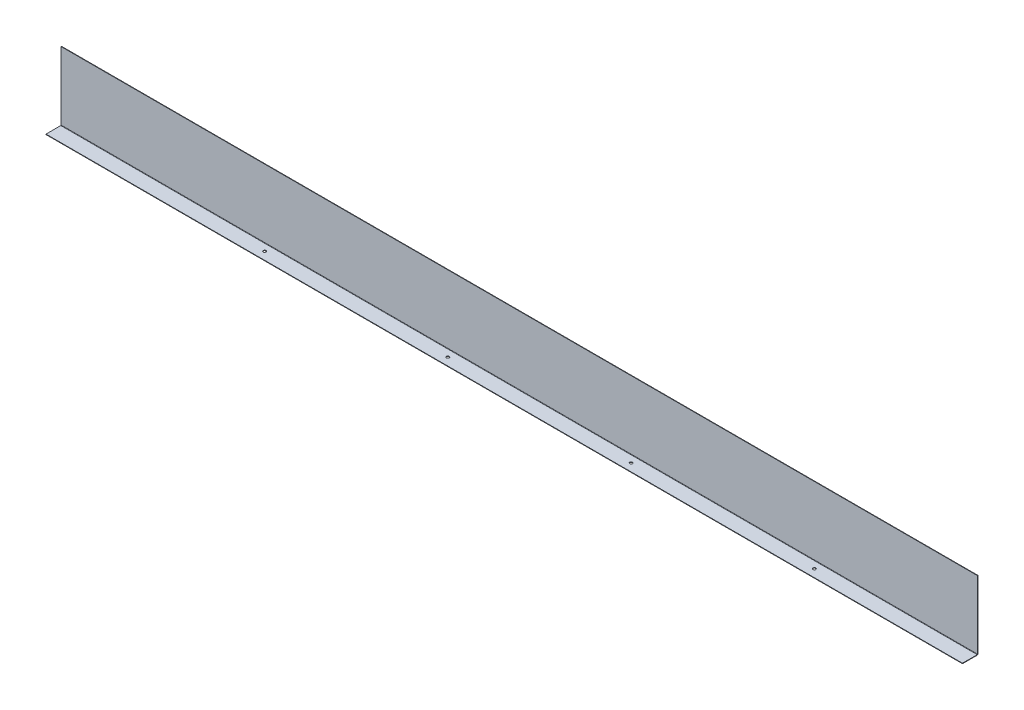
ISO-10303-21;
HEADER;
FILE_DESCRIPTION(('STEP AP214'),'2;1');
FILE_NAME('part.step','',(''),(''),'','','');
FILE_SCHEMA(('AUTOMOTIVE_DESIGN { 1 0 10303 214 1 1 1 1 }'));
ENDSEC;
DATA;
#1=APPLICATION_CONTEXT('core data for automotive mechanical design processes');
#2=APPLICATION_PROTOCOL_DEFINITION('international standard','automotive_design',2000,#1);
#3=PRODUCT_CONTEXT('',#1,'mechanical');
#4=PRODUCT('Part','Part','',(#3));
#5=PRODUCT_RELATED_PRODUCT_CATEGORY('part','',(#4));
#6=PRODUCT_DEFINITION_FORMATION('','',#4);
#7=PRODUCT_DEFINITION_CONTEXT('part definition',#1,'design');
#8=PRODUCT_DEFINITION('design','',#6,#7);
#9=PRODUCT_DEFINITION_SHAPE('','',#8);
#10=(LENGTH_UNIT() NAMED_UNIT(*) SI_UNIT(.MILLI.,.METRE.));
#11=(NAMED_UNIT(*) PLANE_ANGLE_UNIT() SI_UNIT($,.RADIAN.));
#12=(NAMED_UNIT(*) SI_UNIT($,.STERADIAN.) SOLID_ANGLE_UNIT());
#13=UNCERTAINTY_MEASURE_WITH_UNIT(LENGTH_MEASURE(1.E-05),#10,'distance_accuracy_value','');
#14=(GEOMETRIC_REPRESENTATION_CONTEXT(3) GLOBAL_UNCERTAINTY_ASSIGNED_CONTEXT((#13)) GLOBAL_UNIT_ASSIGNED_CONTEXT((#10,
#11,#12)) REPRESENTATION_CONTEXT('',''));
#15=CARTESIAN_POINT('',(0.,0.,0.));
#16=DIRECTION('',(0.,0.,1.));
#17=DIRECTION('',(1.,0.,0.));
#18=AXIS2_PLACEMENT_3D('',#15,#16,#17);
#19=CARTESIAN_POINT('',(2000.,-1.,0.));
#20=DIRECTION('',(0.,1.,0.));
#21=DIRECTION('',(0.,0.,1.));
#22=AXIS2_PLACEMENT_3D('',#19,#20,#21);
#23=PLANE('',#22);
#24=CARTESIAN_POINT('',(460.,-0.999999999999999,-16.95));
#25=DIRECTION('',(0.,1.,0.));
#26=DIRECTION('',(0.,0.,1.));
#27=AXIS2_PLACEMENT_3D('',#24,#25,#26);
#28=CIRCLE('',#27,2.99999999999999);
#29=CARTESIAN_POINT('',(460.,-0.999999999999999,-13.95));
#30=VERTEX_POINT('',#29);
#31=EDGE_CURVE('E229',#30,#30,#28,.T.);
#32=ORIENTED_EDGE('',*,*,#31,.T.);
#33=EDGE_LOOP('',(#32));
#34=FACE_BOUND('',#33,.T.);
#35=CARTESIAN_POINT('',(1260.,-0.999999999999999,-16.95));
#36=DIRECTION('',(0.,1.,0.));
#37=DIRECTION('',(0.,0.,1.));
#38=AXIS2_PLACEMENT_3D('',#35,#36,#37);
#39=CIRCLE('',#38,2.99999999999993);
#40=CARTESIAN_POINT('',(1260.,-0.999999999999999,-13.9500000000001));
#41=VERTEX_POINT('',#40);
#42=EDGE_CURVE('E233',#41,#41,#39,.T.);
#43=ORIENTED_EDGE('',*,*,#42,.T.);
#44=EDGE_LOOP('',(#43));
#45=FACE_BOUND('',#44,.T.);
#46=CARTESIAN_POINT('',(1660.,-0.999999999999999,-16.95));
#47=DIRECTION('',(0.,1.,0.));
#48=DIRECTION('',(0.,0.,1.));
#49=AXIS2_PLACEMENT_3D('',#46,#47,#48);
#50=CIRCLE('',#49,2.99999999999993);
#51=CARTESIAN_POINT('',(1660.,-0.999999999999999,-13.9500000000001));
#52=VERTEX_POINT('',#51);
#53=EDGE_CURVE('E237',#52,#52,#50,.T.);
#54=ORIENTED_EDGE('',*,*,#53,.T.);
#55=EDGE_LOOP('',(#54));
#56=FACE_BOUND('',#55,.T.);
#57=CARTESIAN_POINT('',(860.,-0.999999999999999,-16.95));
#58=DIRECTION('',(0.,1.,0.));
#59=DIRECTION('',(0.,0.,1.));
#60=AXIS2_PLACEMENT_3D('',#57,#58,#59);
#61=CIRCLE('',#60,3.00000000000005);
#62=CARTESIAN_POINT('',(860.,-0.999999999999999,-13.95));
#63=VERTEX_POINT('',#62);
#64=EDGE_CURVE('E164',#63,#63,#61,.T.);
#65=ORIENTED_EDGE('',*,*,#64,.T.);
#66=EDGE_LOOP('',(#65));
#67=FACE_BOUND('',#66,.T.);
#68=DIRECTION('',(-1.,0.,0.));
#69=VECTOR('',#68,1.);
#70=CARTESIAN_POINT('',(0.,-1.00000000000013,-32.1634));
#71=LINE('',#70,#69);
#72=CARTESIAN_POINT('',(0.,-1.00000000000013,-32.1634));
#73=VERTEX_POINT('',#72);
#74=CARTESIAN_POINT('',(2000.,-1.,-32.1634));
#75=VERTEX_POINT('',#74);
#76=EDGE_CURVE('E87',#73,#75,#71,.F.);
#77=ORIENTED_EDGE('',*,*,#76,.T.);
#78=DIRECTION('',(0.,0.,-1.));
#79=VECTOR('',#78,1.);
#80=CARTESIAN_POINT('',(2000.,-1.,0.));
#81=LINE('',#80,#79);
#82=CARTESIAN_POINT('',(2000.,-1.,0.));
#83=VERTEX_POINT('',#82);
#84=EDGE_CURVE('E188',#83,#75,#81,.T.);
#85=ORIENTED_EDGE('',*,*,#84,.F.);
#86=DIRECTION('',(-1.,0.,0.));
#87=VECTOR('',#86,1.);
#88=CARTESIAN_POINT('',(2000.,-1.,0.));
#89=LINE('',#88,#87);
#90=CARTESIAN_POINT('',(0.,-1.,0.));
#91=VERTEX_POINT('',#90);
#92=EDGE_CURVE('E67',#83,#91,#89,.T.);
#93=ORIENTED_EDGE('',*,*,#92,.T.);
#94=DIRECTION('',(0.,0.,-1.));
#95=VECTOR('',#94,1.);
#96=CARTESIAN_POINT('',(0.,-1.,0.));
#97=LINE('',#96,#95);
#98=EDGE_CURVE('E185',#91,#73,#97,.T.);
#99=ORIENTED_EDGE('',*,*,#98,.T.);
#100=EDGE_LOOP('',(#77,#85,#93,#99));
#101=FACE_BOUND('',#100,.T.);
#102=ADVANCED_FACE('F59',(#34,#45,#56,#67,#101),#23,.F.);
#103=CARTESIAN_POINT('',(2000.,0.,0.));
#104=DIRECTION('',(0.,1.,0.));
#105=DIRECTION('',(0.,0.,1.));
#106=AXIS2_PLACEMENT_3D('',#103,#104,#105);
#107=PLANE('',#106);
#108=CARTESIAN_POINT('',(460.,0.,-16.95));
#109=DIRECTION('',(0.,1.,0.));
#110=DIRECTION('',(0.,0.,1.));
#111=AXIS2_PLACEMENT_3D('',#108,#109,#110);
#112=CIRCLE('',#111,2.99999999999999);
#113=CARTESIAN_POINT('',(460.,0.,-13.95));
#114=VERTEX_POINT('',#113);
#115=EDGE_CURVE('E427',#114,#114,#112,.T.);
#116=ORIENTED_EDGE('',*,*,#115,.F.);
#117=EDGE_LOOP('',(#116));
#118=FACE_BOUND('',#117,.T.);
#119=CARTESIAN_POINT('',(1260.,0.,-16.95));
#120=DIRECTION('',(0.,1.,0.));
#121=DIRECTION('',(0.,0.,1.));
#122=AXIS2_PLACEMENT_3D('',#119,#120,#121);
#123=CIRCLE('',#122,2.99999999999993);
#124=CARTESIAN_POINT('',(1260.,0.,-13.9500000000001));
#125=VERTEX_POINT('',#124);
#126=EDGE_CURVE('E434',#125,#125,#123,.T.);
#127=ORIENTED_EDGE('',*,*,#126,.F.);
#128=EDGE_LOOP('',(#127));
#129=FACE_BOUND('',#128,.T.);
#130=CARTESIAN_POINT('',(1660.,0.,-16.95));
#131=DIRECTION('',(0.,1.,0.));
#132=DIRECTION('',(0.,0.,1.));
#133=AXIS2_PLACEMENT_3D('',#130,#131,#132);
#134=CIRCLE('',#133,2.99999999999993);
#135=CARTESIAN_POINT('',(1660.,0.,-13.9500000000001));
#136=VERTEX_POINT('',#135);
#137=EDGE_CURVE('E431',#136,#136,#134,.T.);
#138=ORIENTED_EDGE('',*,*,#137,.F.);
#139=EDGE_LOOP('',(#138));
#140=FACE_BOUND('',#139,.T.);
#141=CARTESIAN_POINT('',(860.,0.,-16.95));
#142=DIRECTION('',(0.,1.,0.));
#143=DIRECTION('',(0.,0.,1.));
#144=AXIS2_PLACEMENT_3D('',#141,#142,#143);
#145=CIRCLE('',#144,3.00000000000005);
#146=CARTESIAN_POINT('',(860.,0.,-13.95));
#147=VERTEX_POINT('',#146);
#148=EDGE_CURVE('E241',#147,#147,#145,.T.);
#149=ORIENTED_EDGE('',*,*,#148,.F.);
#150=EDGE_LOOP('',(#149));
#151=FACE_BOUND('',#150,.T.);
#152=DIRECTION('',(0.,0.,-1.));
#153=VECTOR('',#152,1.);
#154=CARTESIAN_POINT('',(2000.,0.,0.));
#155=LINE('',#154,#153);
#156=CARTESIAN_POINT('',(2000.,0.,0.));
#157=VERTEX_POINT('',#156);
#158=CARTESIAN_POINT('',(2000.,0.,-32.1634));
#159=VERTEX_POINT('',#158);
#160=EDGE_CURVE('E190',#157,#159,#155,.T.);
#161=ORIENTED_EDGE('',*,*,#160,.T.);
#162=DIRECTION('',(-1.,0.,0.));
#163=VECTOR('',#162,1.);
#164=CARTESIAN_POINT('',(0.,-1.27285335049798E-13,-32.1634));
#165=LINE('',#164,#163);
#166=CARTESIAN_POINT('',(0.,-1.27285335049798E-13,-32.1634));
#167=VERTEX_POINT('',#166);
#168=EDGE_CURVE('E176',#167,#159,#165,.F.);
#169=ORIENTED_EDGE('',*,*,#168,.F.);
#170=DIRECTION('',(0.,0.,-1.));
#171=VECTOR('',#170,1.);
#172=CARTESIAN_POINT('',(0.,0.,0.));
#173=LINE('',#172,#171);
#174=CARTESIAN_POINT('',(0.,0.,0.));
#175=VERTEX_POINT('',#174);
#176=EDGE_CURVE('E197',#175,#167,#173,.T.);
#177=ORIENTED_EDGE('',*,*,#176,.F.);
#178=DIRECTION('',(-1.,0.,0.));
#179=VECTOR('',#178,1.);
#180=CARTESIAN_POINT('',(2000.,0.,0.));
#181=LINE('',#180,#179);
#182=EDGE_CURVE('E13',#157,#175,#181,.T.);
#183=ORIENTED_EDGE('',*,*,#182,.F.);
#184=EDGE_LOOP('',(#161,#169,#177,#183));
#185=FACE_BOUND('',#184,.T.);
#186=ADVANCED_FACE('F220',(#118,#129,#140,#151,#185),#107,.T.);
#187=CARTESIAN_POINT('',(2000.,0.,0.));
#188=DIRECTION('',(-1.,0.,0.));
#189=DIRECTION('',(0.,0.,1.));
#190=AXIS2_PLACEMENT_3D('',#187,#188,#189);
#191=PLANE('',#190);
#192=DIRECTION('',(0.,-1.,0.));
#193=VECTOR('',#192,1.);
#194=CARTESIAN_POINT('',(2000.,0.,-32.1634));
#195=LINE('',#194,#193);
#196=EDGE_CURVE('E182',#159,#75,#195,.T.);
#197=ORIENTED_EDGE('',*,*,#196,.F.);
#198=ORIENTED_EDGE('',*,*,#160,.F.);
#199=DIRECTION('',(0.,1.,0.));
#200=VECTOR('',#199,1.);
#201=CARTESIAN_POINT('',(2000.,-1.,0.));
#202=LINE('',#201,#200);
#203=EDGE_CURVE('E194',#83,#157,#202,.T.);
#204=ORIENTED_EDGE('',*,*,#203,.F.);
#205=ORIENTED_EDGE('',*,*,#84,.T.);
#206=EDGE_LOOP('',(#197,#198,#204,#205));
#207=FACE_BOUND('',#206,.T.);
#208=ADVANCED_FACE('F217',(#207),#191,.F.);
#209=CARTESIAN_POINT('',(0.,0.,0.));
#210=DIRECTION('',(-1.,0.,0.));
#211=DIRECTION('',(0.,0.,1.));
#212=AXIS2_PLACEMENT_3D('',#209,#210,#211);
#213=PLANE('',#212);
#214=ORIENTED_EDGE('',*,*,#176,.T.);
#215=DIRECTION('',(0.,-1.,0.));
#216=VECTOR('',#215,1.);
#217=CARTESIAN_POINT('',(0.,-1.27285335049798E-13,-32.1634));
#218=LINE('',#217,#216);
#219=EDGE_CURVE('E170',#167,#73,#218,.T.);
#220=ORIENTED_EDGE('',*,*,#219,.T.);
#221=ORIENTED_EDGE('',*,*,#98,.F.);
#222=DIRECTION('',(0.,1.,0.));
#223=VECTOR('',#222,1.);
#224=CARTESIAN_POINT('',(0.,-1.,0.));
#225=LINE('',#224,#223);
#226=EDGE_CURVE('E191',#91,#175,#225,.T.);
#227=ORIENTED_EDGE('',*,*,#226,.T.);
#228=EDGE_LOOP('',(#214,#220,#221,#227));
#229=FACE_BOUND('',#228,.T.);
#230=ADVANCED_FACE('F204',(#229),#213,.T.);
#231=CARTESIAN_POINT('',(2000.,-1.,0.));
#232=DIRECTION('',(0.,0.,1.));
#233=DIRECTION('',(1.,0.,0.));
#234=AXIS2_PLACEMENT_3D('',#231,#232,#233);
#235=PLANE('',#234);
#236=ORIENTED_EDGE('',*,*,#226,.F.);
#237=ORIENTED_EDGE('',*,*,#92,.F.);
#238=ORIENTED_EDGE('',*,*,#203,.T.);
#239=ORIENTED_EDGE('',*,*,#182,.T.);
#240=EDGE_LOOP('',(#236,#237,#238,#239));
#241=FACE_BOUND('',#240,.T.);
#242=ADVANCED_FACE('F206',(#241),#235,.T.);
#243=CARTESIAN_POINT('',(2000.,0.736600000000017,-32.1634));
#244=DIRECTION('',(1.,0.,0.));
#245=DIRECTION('',(0.,1.,0.));
#246=AXIS2_PLACEMENT_3D('',#243,#244,#245);
#247=PLANE('',#246);
#248=DIRECTION('',(0.,0.,1.));
#249=VECTOR('',#248,1.);
#250=CARTESIAN_POINT('',(2000.,0.736600000000004,-33.9));
#251=LINE('',#250,#249);
#252=CARTESIAN_POINT('',(2000.,0.736600000000014,-32.9));
#253=VERTEX_POINT('',#252);
#254=CARTESIAN_POINT('',(2000.,0.736600000000011,-33.9));
#255=VERTEX_POINT('',#254);
#256=EDGE_CURVE('E147',#253,#255,#251,.F.);
#257=ORIENTED_EDGE('',*,*,#256,.F.);
#258=CARTESIAN_POINT('',(2000.,0.736600000000017,-32.1634));
#259=DIRECTION('',(-1.,0.,0.));
#260=DIRECTION('',(0.,-1.,0.));
#261=AXIS2_PLACEMENT_3D('',#258,#259,#260);
#262=CIRCLE('',#261,0.736599999999997);
#263=EDGE_CURVE('E173',#159,#253,#262,.F.);
#264=ORIENTED_EDGE('',*,*,#263,.F.);
#265=ORIENTED_EDGE('',*,*,#196,.T.);
#266=CARTESIAN_POINT('',(2000.,0.736600000000017,-32.1634));
#267=DIRECTION('',(-1.,0.,0.));
#268=DIRECTION('',(0.,-1.,0.));
#269=AXIS2_PLACEMENT_3D('',#266,#267,#268);
#270=CIRCLE('',#269,1.7366);
#271=EDGE_CURVE('E166',#75,#255,#270,.F.);
#272=ORIENTED_EDGE('',*,*,#271,.T.);
#273=EDGE_LOOP('',(#257,#264,#265,#272));
#274=FACE_BOUND('',#273,.T.);
#275=ADVANCED_FACE('F208',(#274),#247,.T.);
#276=CARTESIAN_POINT('',(0.,0.73659999999987,-32.1634));
#277=DIRECTION('',(1.,0.,0.));
#278=DIRECTION('',(0.,1.,0.));
#279=AXIS2_PLACEMENT_3D('',#276,#277,#278);
#280=PLANE('',#279);
#281=CARTESIAN_POINT('',(0.,0.73659999999987,-32.1634));
#282=DIRECTION('',(-1.,0.,0.));
#283=DIRECTION('',(0.,-1.,0.));
#284=AXIS2_PLACEMENT_3D('',#281,#282,#283);
#285=CIRCLE('',#284,0.736599999999997);
#286=CARTESIAN_POINT('',(0.,0.736599999999867,-32.9));
#287=VERTEX_POINT('',#286);
#288=EDGE_CURVE('E179',#287,#167,#285,.T.);
#289=ORIENTED_EDGE('',*,*,#288,.F.);
#290=DIRECTION('',(0.,0.,1.));
#291=VECTOR('',#290,1.);
#292=CARTESIAN_POINT('',(0.,0.7365999999999,-32.9));
#293=LINE('',#292,#291);
#294=CARTESIAN_POINT('',(0.,0.736599999999907,-33.9));
#295=VERTEX_POINT('',#294);
#296=EDGE_CURVE('E158',#287,#295,#293,.F.);
#297=ORIENTED_EDGE('',*,*,#296,.T.);
#298=CARTESIAN_POINT('',(0.,0.73659999999987,-32.1634));
#299=DIRECTION('',(-1.,0.,0.));
#300=DIRECTION('',(0.,-1.,0.));
#301=AXIS2_PLACEMENT_3D('',#298,#299,#300);
#302=CIRCLE('',#301,1.7366);
#303=EDGE_CURVE('E167',#295,#73,#302,.T.);
#304=ORIENTED_EDGE('',*,*,#303,.T.);
#305=ORIENTED_EDGE('',*,*,#219,.F.);
#306=EDGE_LOOP('',(#289,#297,#304,#305));
#307=FACE_BOUND('',#306,.T.);
#308=ADVANCED_FACE('F214',(#307),#280,.F.);
#309=CARTESIAN_POINT('',(0.,0.73659999999987,-32.1634));
#310=DIRECTION('',(-1.,0.,0.));
#311=DIRECTION('',(0.,0.,-1.));
#312=AXIS2_PLACEMENT_3D('',#309,#310,#311);
#313=CYLINDRICAL_SURFACE('',#312,1.7366);
#314=ORIENTED_EDGE('',*,*,#76,.F.);
#315=ORIENTED_EDGE('',*,*,#303,.F.);
#316=DIRECTION('',(-1.,0.,0.));
#317=VECTOR('',#316,1.);
#318=CARTESIAN_POINT('',(2000.,0.736600000000004,-33.9));
#319=LINE('',#318,#317);
#320=EDGE_CURVE('E156',#295,#255,#319,.F.);
#321=ORIENTED_EDGE('',*,*,#320,.T.);
#322=ORIENTED_EDGE('',*,*,#271,.F.);
#323=EDGE_LOOP('',(#314,#315,#321,#322));
#324=FACE_BOUND('',#323,.T.);
#325=ADVANCED_FACE('F270',(#324),#313,.T.);
#326=CARTESIAN_POINT('',(0.,0.73659999999987,-32.1634));
#327=DIRECTION('',(-1.,0.,0.));
#328=DIRECTION('',(0.,0.,-1.));
#329=AXIS2_PLACEMENT_3D('',#326,#327,#328);
#330=CYLINDRICAL_SURFACE('',#329,0.736599999999997);
#331=ORIENTED_EDGE('',*,*,#168,.T.);
#332=ORIENTED_EDGE('',*,*,#263,.T.);
#333=DIRECTION('',(-1.,0.,0.));
#334=VECTOR('',#333,1.);
#335=CARTESIAN_POINT('',(2000.,0.736599999999997,-32.9));
#336=LINE('',#335,#334);
#337=EDGE_CURVE('E161',#253,#287,#336,.T.);
#338=ORIENTED_EDGE('',*,*,#337,.T.);
#339=ORIENTED_EDGE('',*,*,#288,.T.);
#340=EDGE_LOOP('',(#331,#332,#338,#339));
#341=FACE_BOUND('',#340,.T.);
#342=ADVANCED_FACE('F254',(#341),#330,.F.);
#343=CARTESIAN_POINT('',(2000.,0.,-33.9));
#344=DIRECTION('',(-1.,0.,0.));
#345=DIRECTION('',(0.,0.,1.));
#346=AXIS2_PLACEMENT_3D('',#343,#344,#345);
#347=PLANE('',#346);
#348=ORIENTED_EDGE('',*,*,#256,.T.);
#349=DIRECTION('',(0.,-1.,0.));
#350=VECTOR('',#349,1.);
#351=CARTESIAN_POINT('',(2000.,-1.21895090403837E-13,-33.9));
#352=LINE('',#351,#350);
#353=CARTESIAN_POINT('',(2000.,149.,-33.9000000000005));
#354=VERTEX_POINT('',#353);
#355=EDGE_CURVE('E128',#354,#255,#352,.T.);
#356=ORIENTED_EDGE('',*,*,#355,.F.);
#357=DIRECTION('',(0.,0.,1.));
#358=VECTOR('',#357,1.);
#359=CARTESIAN_POINT('',(2000.,149.,-33.9000000000005));
#360=LINE('',#359,#358);
#361=CARTESIAN_POINT('',(2000.,149.,-32.9000000000005));
#362=VERTEX_POINT('',#361);
#363=EDGE_CURVE('E134',#354,#362,#360,.T.);
#364=ORIENTED_EDGE('',*,*,#363,.T.);
#365=DIRECTION('',(0.,1.,0.));
#366=VECTOR('',#365,1.);
#367=CARTESIAN_POINT('',(2000.,0.,-32.9));
#368=LINE('',#367,#366);
#369=EDGE_CURVE('E154',#362,#253,#368,.F.);
#370=ORIENTED_EDGE('',*,*,#369,.T.);
#371=EDGE_LOOP('',(#348,#356,#364,#370));
#372=FACE_BOUND('',#371,.T.);
#373=ADVANCED_FACE('F146',(#372),#347,.F.);
#374=CARTESIAN_POINT('',(0.,149.,-33.9000000000005));
#375=DIRECTION('',(1.,0.,0.));
#376=DIRECTION('',(0.,0.,-1.));
#377=AXIS2_PLACEMENT_3D('',#374,#375,#376);
#378=PLANE('',#377);
#379=ORIENTED_EDGE('',*,*,#296,.F.);
#380=DIRECTION('',(0.,-1.,0.));
#381=VECTOR('',#380,1.);
#382=CARTESIAN_POINT('',(0.,149.,-32.9000000000005));
#383=LINE('',#382,#381);
#384=CARTESIAN_POINT('',(0.,149.,-32.9000000000005));
#385=VERTEX_POINT('',#384);
#386=EDGE_CURVE('E150',#287,#385,#383,.F.);
#387=ORIENTED_EDGE('',*,*,#386,.T.);
#388=DIRECTION('',(0.,0.,1.));
#389=VECTOR('',#388,1.);
#390=CARTESIAN_POINT('',(0.,149.,-33.9000000000005));
#391=LINE('',#390,#389);
#392=CARTESIAN_POINT('',(0.,149.,-33.9000000000005));
#393=VERTEX_POINT('',#392);
#394=EDGE_CURVE('E143',#393,#385,#391,.T.);
#395=ORIENTED_EDGE('',*,*,#394,.F.);
#396=DIRECTION('',(0.,1.,0.));
#397=VECTOR('',#396,1.);
#398=CARTESIAN_POINT('',(0.,-1.21895090403837E-13,-33.9));
#399=LINE('',#398,#397);
#400=EDGE_CURVE('E130',#295,#393,#399,.T.);
#401=ORIENTED_EDGE('',*,*,#400,.F.);
#402=EDGE_LOOP('',(#379,#387,#395,#401));
#403=FACE_BOUND('',#402,.T.);
#404=ADVANCED_FACE('F258',(#403),#378,.F.);
#405=CARTESIAN_POINT('',(0.,-1.21895090403837E-13,-33.9));
#406=DIRECTION('',(0.,0.,1.));
#407=DIRECTION('',(0.,-1.,0.));
#408=AXIS2_PLACEMENT_3D('',#405,#406,#407);
#409=PLANE('',#408);
#410=ORIENTED_EDGE('',*,*,#320,.F.);
#411=ORIENTED_EDGE('',*,*,#400,.T.);
#412=DIRECTION('',(1.,0.,0.));
#413=VECTOR('',#412,1.);
#414=CARTESIAN_POINT('',(0.,149.,-33.9000000000005));
#415=LINE('',#414,#413);
#416=EDGE_CURVE('E123',#393,#354,#415,.T.);
#417=ORIENTED_EDGE('',*,*,#416,.T.);
#418=ORIENTED_EDGE('',*,*,#355,.T.);
#419=EDGE_LOOP('',(#410,#411,#417,#418));
#420=FACE_BOUND('',#419,.T.);
#421=ADVANCED_FACE('F126',(#420),#409,.F.);
#422=CARTESIAN_POINT('',(0.,-1.18403609064994E-13,-32.9));
#423=DIRECTION('',(0.,0.,1.));
#424=DIRECTION('',(0.,-1.,0.));
#425=AXIS2_PLACEMENT_3D('',#422,#423,#424);
#426=PLANE('',#425);
#427=ORIENTED_EDGE('',*,*,#386,.F.);
#428=ORIENTED_EDGE('',*,*,#337,.F.);
#429=ORIENTED_EDGE('',*,*,#369,.F.);
#430=DIRECTION('',(-1.,0.,0.));
#431=VECTOR('',#430,1.);
#432=CARTESIAN_POINT('',(2000.,149.,-32.9000000000005));
#433=LINE('',#432,#431);
#434=EDGE_CURVE('E139',#385,#362,#433,.F.);
#435=ORIENTED_EDGE('',*,*,#434,.F.);
#436=EDGE_LOOP('',(#427,#428,#429,#435));
#437=FACE_BOUND('',#436,.T.);
#438=ADVANCED_FACE('F250',(#437),#426,.T.);
#439=CARTESIAN_POINT('',(2000.,149.,-33.9000000000005));
#440=DIRECTION('',(0.,-1.,0.));
#441=DIRECTION('',(0.,0.,-1.));
#442=AXIS2_PLACEMENT_3D('',#439,#440,#441);
#443=PLANE('',#442);
#444=ORIENTED_EDGE('',*,*,#434,.T.);
#445=ORIENTED_EDGE('',*,*,#363,.F.);
#446=ORIENTED_EDGE('',*,*,#416,.F.);
#447=ORIENTED_EDGE('',*,*,#394,.T.);
#448=EDGE_LOOP('',(#444,#445,#446,#447));
#449=FACE_BOUND('',#448,.T.);
#450=ADVANCED_FACE('F137',(#449),#443,.F.);
#451=CARTESIAN_POINT('',(860.,-10.,-16.95));
#452=DIRECTION('',(0.,1.,0.));
#453=DIRECTION('',(0.,0.,1.));
#454=AXIS2_PLACEMENT_3D('',#451,#452,#453);
#455=CYLINDRICAL_SURFACE('',#454,3.00000000000005);
#456=ORIENTED_EDGE('',*,*,#148,.T.);
#457=EDGE_LOOP('',(#456));
#458=FACE_BOUND('',#457,.T.);
#459=ORIENTED_EDGE('',*,*,#64,.F.);
#460=EDGE_LOOP('',(#459));
#461=FACE_BOUND('',#460,.T.);
#462=ADVANCED_FACE('F357',(#458,#461),#455,.F.);
#463=CARTESIAN_POINT('',(1660.,-10.,-16.95));
#464=DIRECTION('',(0.,1.,0.));
#465=DIRECTION('',(0.,0.,1.));
#466=AXIS2_PLACEMENT_3D('',#463,#464,#465);
#467=CYLINDRICAL_SURFACE('',#466,2.99999999999993);
#468=ORIENTED_EDGE('',*,*,#137,.T.);
#469=EDGE_LOOP('',(#468));
#470=FACE_BOUND('',#469,.T.);
#471=ORIENTED_EDGE('',*,*,#53,.F.);
#472=EDGE_LOOP('',(#471));
#473=FACE_BOUND('',#472,.T.);
#474=ADVANCED_FACE('F365',(#470,#473),#467,.F.);
#475=CARTESIAN_POINT('',(1260.,-10.,-16.95));
#476=DIRECTION('',(0.,1.,0.));
#477=DIRECTION('',(0.,0.,1.));
#478=AXIS2_PLACEMENT_3D('',#475,#476,#477);
#479=CYLINDRICAL_SURFACE('',#478,2.99999999999993);
#480=ORIENTED_EDGE('',*,*,#126,.T.);
#481=EDGE_LOOP('',(#480));
#482=FACE_BOUND('',#481,.T.);
#483=ORIENTED_EDGE('',*,*,#42,.F.);
#484=EDGE_LOOP('',(#483));
#485=FACE_BOUND('',#484,.T.);
#486=ADVANCED_FACE('F384',(#482,#485),#479,.F.);
#487=CARTESIAN_POINT('',(460.,-10.,-16.95));
#488=DIRECTION('',(0.,1.,0.));
#489=DIRECTION('',(0.,0.,1.));
#490=AXIS2_PLACEMENT_3D('',#487,#488,#489);
#491=CYLINDRICAL_SURFACE('',#490,2.99999999999999);
#492=ORIENTED_EDGE('',*,*,#115,.T.);
#493=EDGE_LOOP('',(#492));
#494=FACE_BOUND('',#493,.T.);
#495=ORIENTED_EDGE('',*,*,#31,.F.);
#496=EDGE_LOOP('',(#495));
#497=FACE_BOUND('',#496,.T.);
#498=ADVANCED_FACE('F395',(#494,#497),#491,.F.);
#499=CLOSED_SHELL('',(#102,#186,#208,#230,#242,#275,#308,#325,#342,#373,#404,#421,#438,#450,
#462,#474,#486,#498));
#500=MANIFOLD_SOLID_BREP('B2',#499);
#501=ADVANCED_BREP_SHAPE_REPRESENTATION('',(#18,#500),#14);
#502=SHAPE_DEFINITION_REPRESENTATION(#9,#501);
ENDSEC;
END-ISO-10303-21;
